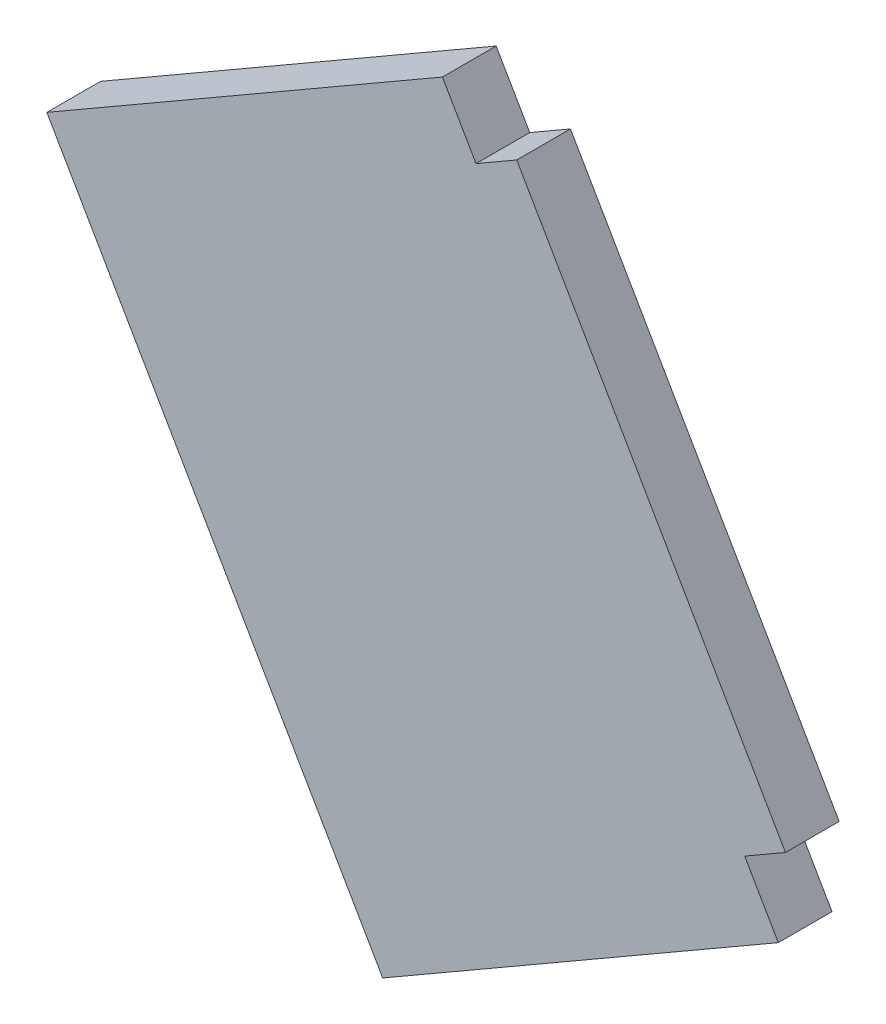
ISO-10303-21;
HEADER;
FILE_DESCRIPTION(('STEP AP214'),'2;1');
FILE_NAME('part.step','',(''),(''),'','','');
FILE_SCHEMA(('AUTOMOTIVE_DESIGN { 1 0 10303 214 1 1 1 1 }'));
ENDSEC;
DATA;
#1=APPLICATION_CONTEXT('core data for automotive mechanical design processes');
#2=APPLICATION_PROTOCOL_DEFINITION('international standard','automotive_design',2000,#1);
#3=PRODUCT_CONTEXT('',#1,'mechanical');
#4=PRODUCT('Part','Part','',(#3));
#5=PRODUCT_RELATED_PRODUCT_CATEGORY('part','',(#4));
#6=PRODUCT_DEFINITION_FORMATION('','',#4);
#7=PRODUCT_DEFINITION_CONTEXT('part definition',#1,'design');
#8=PRODUCT_DEFINITION('design','',#6,#7);
#9=PRODUCT_DEFINITION_SHAPE('','',#8);
#10=(LENGTH_UNIT() NAMED_UNIT(*) SI_UNIT(.MILLI.,.METRE.));
#11=(NAMED_UNIT(*) PLANE_ANGLE_UNIT() SI_UNIT($,.RADIAN.));
#12=(NAMED_UNIT(*) SI_UNIT($,.STERADIAN.) SOLID_ANGLE_UNIT());
#13=UNCERTAINTY_MEASURE_WITH_UNIT(LENGTH_MEASURE(1.E-05),#10,'distance_accuracy_value','');
#14=(GEOMETRIC_REPRESENTATION_CONTEXT(3) GLOBAL_UNCERTAINTY_ASSIGNED_CONTEXT((#13)) GLOBAL_UNIT_ASSIGNED_CONTEXT((#10,
#11,#12)) REPRESENTATION_CONTEXT('',''));
#15=CARTESIAN_POINT('',(0.,0.,0.));
#16=DIRECTION('',(0.,0.,1.));
#17=DIRECTION('',(1.,0.,0.));
#18=AXIS2_PLACEMENT_3D('',#15,#16,#17);
#19=CARTESIAN_POINT('',(-1.42664718204935,-1.40102540378444,0.));
#20=DIRECTION('',(0.500000000000001,-0.866025403784438,0.));
#21=DIRECTION('',(0.866025403784438,0.500000000000001,0.));
#22=AXIS2_PLACEMENT_3D('',#19,#20,#21);
#23=PLANE('',#22);
#24=DIRECTION('',(0.866025403784438,0.500000000000001,0.));
#25=VECTOR('',#24,1.);
#26=CARTESIAN_POINT('',(-1.42664718204935,-1.40102540378444,0.08));
#27=LINE('',#26,#25);
#28=CARTESIAN_POINT('',(-2.01554445662277,-1.74102540378444,0.08));
#29=VERTEX_POINT('',#28);
#30=CARTESIAN_POINT('',(-1.42664718204935,-1.40102540378444,0.08));
#31=VERTEX_POINT('',#30);
#32=EDGE_CURVE('E130',#29,#31,#27,.T.);
#33=ORIENTED_EDGE('',*,*,#32,.F.);
#34=DIRECTION('',(0.,0.,1.));
#35=VECTOR('',#34,1.);
#36=CARTESIAN_POINT('',(-2.01554445662277,-1.74102540378444,0.));
#37=LINE('',#36,#35);
#38=CARTESIAN_POINT('',(-2.01554445662277,-1.74102540378444,0.));
#39=VERTEX_POINT('',#38);
#40=EDGE_CURVE('E11',#39,#29,#37,.T.);
#41=ORIENTED_EDGE('',*,*,#40,.F.);
#42=DIRECTION('',(0.866025403784438,0.500000000000001,0.));
#43=VECTOR('',#42,1.);
#44=CARTESIAN_POINT('',(-1.42664718204935,-1.40102540378444,0.));
#45=LINE('',#44,#43);
#46=CARTESIAN_POINT('',(-1.42664718204935,-1.40102540378444,0.));
#47=VERTEX_POINT('',#46);
#48=EDGE_CURVE('E150',#39,#47,#45,.T.);
#49=ORIENTED_EDGE('',*,*,#48,.T.);
#50=DIRECTION('',(0.,0.,1.));
#51=VECTOR('',#50,1.);
#52=CARTESIAN_POINT('',(-1.42664718204935,-1.40102540378444,0.));
#53=LINE('',#52,#51);
#54=EDGE_CURVE('E36',#47,#31,#53,.T.);
#55=ORIENTED_EDGE('',*,*,#54,.T.);
#56=EDGE_LOOP('',(#33,#41,#49,#55));
#57=FACE_BOUND('',#56,.T.);
#58=ADVANCED_FACE('F33',(#57),#23,.T.);
#59=CARTESIAN_POINT('',(-2.51554445662277,-0.875000000000002,0.));
#60=DIRECTION('',(-0.866025403784438,-0.5,0.));
#61=DIRECTION('',(0.5,-0.866025403784438,0.));
#62=AXIS2_PLACEMENT_3D('',#59,#60,#61);
#63=PLANE('',#62);
#64=DIRECTION('',(0.5,-0.866025403784438,0.));
#65=VECTOR('',#64,1.);
#66=CARTESIAN_POINT('',(-2.51554445662277,-0.875000000000002,0.08));
#67=LINE('',#66,#65);
#68=CARTESIAN_POINT('',(-2.51554445662277,-0.875000000000002,0.08));
#69=VERTEX_POINT('',#68);
#70=EDGE_CURVE('E148',#69,#29,#67,.T.);
#71=ORIENTED_EDGE('',*,*,#70,.F.);
#72=DIRECTION('',(0.,0.,1.));
#73=VECTOR('',#72,1.);
#74=CARTESIAN_POINT('',(-2.51554445662277,-0.875000000000002,0.));
#75=LINE('',#74,#73);
#76=CARTESIAN_POINT('',(-2.51554445662277,-0.875000000000002,0.));
#77=VERTEX_POINT('',#76);
#78=EDGE_CURVE('E42',#77,#69,#75,.T.);
#79=ORIENTED_EDGE('',*,*,#78,.F.);
#80=DIRECTION('',(0.5,-0.866025403784438,0.));
#81=VECTOR('',#80,1.);
#82=CARTESIAN_POINT('',(-2.51554445662277,-0.875000000000002,0.));
#83=LINE('',#82,#81);
#84=EDGE_CURVE('E120',#77,#39,#83,.T.);
#85=ORIENTED_EDGE('',*,*,#84,.T.);
#86=ORIENTED_EDGE('',*,*,#40,.T.);
#87=EDGE_LOOP('',(#71,#79,#85,#86));
#88=FACE_BOUND('',#87,.T.);
#89=ADVANCED_FACE('F162',(#88),#63,.T.);
#90=CARTESIAN_POINT('',(-1.92664718204935,-0.535000000000002,0.));
#91=DIRECTION('',(-0.500000000000001,0.866025403784438,0.));
#92=DIRECTION('',(-0.866025403784438,-0.500000000000001,0.));
#93=AXIS2_PLACEMENT_3D('',#90,#91,#92);
#94=PLANE('',#93);
#95=DIRECTION('',(-0.866025403784438,-0.500000000000001,0.));
#96=VECTOR('',#95,1.);
#97=CARTESIAN_POINT('',(-1.92664718204935,-0.535000000000002,0.08));
#98=LINE('',#97,#96);
#99=CARTESIAN_POINT('',(-1.92664718204935,-0.535000000000002,0.08));
#100=VERTEX_POINT('',#99);
#101=EDGE_CURVE('E107',#100,#69,#98,.T.);
#102=ORIENTED_EDGE('',*,*,#101,.F.);
#103=DIRECTION('',(0.,0.,1.));
#104=VECTOR('',#103,1.);
#105=CARTESIAN_POINT('',(-1.92664718204935,-0.535000000000002,0.));
#106=LINE('',#105,#104);
#107=CARTESIAN_POINT('',(-1.92664718204935,-0.535000000000002,0.));
#108=VERTEX_POINT('',#107);
#109=EDGE_CURVE('E102',#108,#100,#106,.T.);
#110=ORIENTED_EDGE('',*,*,#109,.F.);
#111=DIRECTION('',(-0.866025403784438,-0.500000000000001,0.));
#112=VECTOR('',#111,1.);
#113=CARTESIAN_POINT('',(-1.92664718204935,-0.535000000000002,0.));
#114=LINE('',#113,#112);
#115=EDGE_CURVE('E105',#108,#77,#114,.T.);
#116=ORIENTED_EDGE('',*,*,#115,.T.);
#117=ORIENTED_EDGE('',*,*,#78,.T.);
#118=EDGE_LOOP('',(#102,#110,#116,#117));
#119=FACE_BOUND('',#118,.T.);
#120=ADVANCED_FACE('F104',(#119),#94,.T.);
#121=CARTESIAN_POINT('',(-1.92664718204935,-0.535000000000002,0.));
#122=DIRECTION('',(0.866025403784438,0.500000000000002,0.));
#123=DIRECTION('',(-0.500000000000002,0.866025403784438,0.));
#124=AXIS2_PLACEMENT_3D('',#121,#122,#123);
#125=PLANE('',#124);
#126=DIRECTION('',(-0.500000000000002,0.866025403784438,0.));
#127=VECTOR('',#126,1.);
#128=CARTESIAN_POINT('',(-1.92664718204935,-0.535000000000002,0.08));
#129=LINE('',#128,#127);
#130=CARTESIAN_POINT('',(-1.87664718204935,-0.621602540378445,0.08));
#131=VERTEX_POINT('',#130);
#132=EDGE_CURVE('E145',#131,#100,#129,.T.);
#133=ORIENTED_EDGE('',*,*,#132,.F.);
#134=DIRECTION('',(0.,0.,1.));
#135=VECTOR('',#134,1.);
#136=CARTESIAN_POINT('',(-1.87664718204935,-0.621602540378445,0.));
#137=LINE('',#136,#135);
#138=CARTESIAN_POINT('',(-1.87664718204935,-0.621602540378445,0.));
#139=VERTEX_POINT('',#138);
#140=EDGE_CURVE('E112',#139,#131,#137,.T.);
#141=ORIENTED_EDGE('',*,*,#140,.F.);
#142=DIRECTION('',(-0.500000000000002,0.866025403784438,0.));
#143=VECTOR('',#142,1.);
#144=CARTESIAN_POINT('',(-1.92664718204935,-0.535000000000002,0.));
#145=LINE('',#144,#143);
#146=EDGE_CURVE('E118',#139,#108,#145,.T.);
#147=ORIENTED_EDGE('',*,*,#146,.T.);
#148=ORIENTED_EDGE('',*,*,#109,.T.);
#149=EDGE_LOOP('',(#133,#141,#147,#148));
#150=FACE_BOUND('',#149,.T.);
#151=ADVANCED_FACE('F122',(#150),#125,.T.);
#152=CARTESIAN_POINT('',(-1.87664718204935,-0.621602540378445,0.));
#153=DIRECTION('',(-0.5,0.866025403784439,0.));
#154=DIRECTION('',(-0.866025403784439,-0.5,0.));
#155=AXIS2_PLACEMENT_3D('',#152,#153,#154);
#156=PLANE('',#155);
#157=DIRECTION('',(-0.866025403784439,-0.5,0.));
#158=VECTOR('',#157,1.);
#159=CARTESIAN_POINT('',(-1.87664718204935,-0.621602540378445,0.08));
#160=LINE('',#159,#158);
#161=CARTESIAN_POINT('',(-1.81602540378444,-0.586602540378445,0.08));
#162=VERTEX_POINT('',#161);
#163=EDGE_CURVE('E142',#162,#131,#160,.T.);
#164=ORIENTED_EDGE('',*,*,#163,.F.);
#165=DIRECTION('',(0.,0.,1.));
#166=VECTOR('',#165,1.);
#167=CARTESIAN_POINT('',(-1.81602540378444,-0.586602540378445,0.));
#168=LINE('',#167,#166);
#169=CARTESIAN_POINT('',(-1.81602540378444,-0.586602540378445,0.));
#170=VERTEX_POINT('',#169);
#171=EDGE_CURVE('E154',#170,#162,#168,.T.);
#172=ORIENTED_EDGE('',*,*,#171,.F.);
#173=DIRECTION('',(-0.866025403784439,-0.5,0.));
#174=VECTOR('',#173,1.);
#175=CARTESIAN_POINT('',(-1.87664718204935,-0.621602540378445,0.));
#176=LINE('',#175,#174);
#177=EDGE_CURVE('E123',#170,#139,#176,.T.);
#178=ORIENTED_EDGE('',*,*,#177,.T.);
#179=ORIENTED_EDGE('',*,*,#140,.T.);
#180=EDGE_LOOP('',(#164,#172,#178,#179));
#181=FACE_BOUND('',#180,.T.);
#182=ADVANCED_FACE('F175',(#181),#156,.T.);
#183=CARTESIAN_POINT('',(-1.81602540378444,-0.586602540378445,0.));
#184=DIRECTION('',(0.866025403784438,0.500000000000001,0.));
#185=DIRECTION('',(-0.500000000000001,0.866025403784438,0.));
#186=AXIS2_PLACEMENT_3D('',#183,#184,#185);
#187=PLANE('',#186);
#188=DIRECTION('',(-0.500000000000001,0.866025403784438,0.));
#189=VECTOR('',#188,1.);
#190=CARTESIAN_POINT('',(-1.81602540378444,-0.586602540378445,0.08));
#191=LINE('',#190,#189);
#192=CARTESIAN_POINT('',(-1.41602540378444,-1.279422863406,0.08));
#193=VERTEX_POINT('',#192);
#194=EDGE_CURVE('E139',#193,#162,#191,.T.);
#195=ORIENTED_EDGE('',*,*,#194,.F.);
#196=DIRECTION('',(0.,0.,1.));
#197=VECTOR('',#196,1.);
#198=CARTESIAN_POINT('',(-1.41602540378444,-1.279422863406,0.));
#199=LINE('',#198,#197);
#200=CARTESIAN_POINT('',(-1.41602540378444,-1.279422863406,0.));
#201=VERTEX_POINT('',#200);
#202=EDGE_CURVE('E156',#201,#193,#199,.T.);
#203=ORIENTED_EDGE('',*,*,#202,.F.);
#204=DIRECTION('',(-0.500000000000001,0.866025403784438,0.));
#205=VECTOR('',#204,1.);
#206=CARTESIAN_POINT('',(-1.81602540378444,-0.586602540378445,0.));
#207=LINE('',#206,#205);
#208=EDGE_CURVE('E125',#201,#170,#207,.T.);
#209=ORIENTED_EDGE('',*,*,#208,.T.);
#210=ORIENTED_EDGE('',*,*,#171,.T.);
#211=EDGE_LOOP('',(#195,#203,#209,#210));
#212=FACE_BOUND('',#211,.T.);
#213=ADVANCED_FACE('F178',(#212),#187,.T.);
#214=CARTESIAN_POINT('',(-1.47664718204935,-1.314422863406,0.));
#215=DIRECTION('',(0.499999999999999,-0.866025403784439,0.));
#216=DIRECTION('',(0.866025403784439,0.499999999999999,0.));
#217=AXIS2_PLACEMENT_3D('',#214,#215,#216);
#218=PLANE('',#217);
#219=DIRECTION('',(0.866025403784439,0.499999999999999,0.));
#220=VECTOR('',#219,1.);
#221=CARTESIAN_POINT('',(-1.47664718204935,-1.314422863406,0.08));
#222=LINE('',#221,#220);
#223=CARTESIAN_POINT('',(-1.47664718204935,-1.314422863406,0.08));
#224=VERTEX_POINT('',#223);
#225=EDGE_CURVE('E136',#224,#193,#222,.T.);
#226=ORIENTED_EDGE('',*,*,#225,.F.);
#227=DIRECTION('',(0.,0.,1.));
#228=VECTOR('',#227,1.);
#229=CARTESIAN_POINT('',(-1.47664718204935,-1.314422863406,0.));
#230=LINE('',#229,#228);
#231=CARTESIAN_POINT('',(-1.47664718204935,-1.314422863406,0.));
#232=VERTEX_POINT('',#231);
#233=EDGE_CURVE('E157',#232,#224,#230,.T.);
#234=ORIENTED_EDGE('',*,*,#233,.F.);
#235=DIRECTION('',(0.866025403784439,0.499999999999999,0.));
#236=VECTOR('',#235,1.);
#237=CARTESIAN_POINT('',(-1.47664718204935,-1.314422863406,0.));
#238=LINE('',#237,#236);
#239=EDGE_CURVE('E253',#232,#201,#238,.T.);
#240=ORIENTED_EDGE('',*,*,#239,.T.);
#241=ORIENTED_EDGE('',*,*,#202,.T.);
#242=EDGE_LOOP('',(#226,#234,#240,#241));
#243=FACE_BOUND('',#242,.T.);
#244=ADVANCED_FACE('F182',(#243),#218,.T.);
#245=CARTESIAN_POINT('',(-1.42664718204935,-1.40102540378444,0.));
#246=DIRECTION('',(0.866025403784438,0.500000000000002,0.));
#247=DIRECTION('',(-0.500000000000002,0.866025403784438,0.));
#248=AXIS2_PLACEMENT_3D('',#245,#246,#247);
#249=PLANE('',#248);
#250=DIRECTION('',(-0.500000000000002,0.866025403784438,0.));
#251=VECTOR('',#250,1.);
#252=CARTESIAN_POINT('',(-1.42664718204935,-1.40102540378444,0.08));
#253=LINE('',#252,#251);
#254=EDGE_CURVE('E133',#31,#224,#253,.T.);
#255=ORIENTED_EDGE('',*,*,#254,.F.);
#256=ORIENTED_EDGE('',*,*,#54,.F.);
#257=DIRECTION('',(-0.500000000000002,0.866025403784438,0.));
#258=VECTOR('',#257,1.);
#259=CARTESIAN_POINT('',(-1.42664718204935,-1.40102540378444,0.));
#260=LINE('',#259,#258);
#261=EDGE_CURVE('E254',#47,#232,#260,.T.);
#262=ORIENTED_EDGE('',*,*,#261,.T.);
#263=ORIENTED_EDGE('',*,*,#233,.T.);
#264=EDGE_LOOP('',(#255,#256,#262,#263));
#265=FACE_BOUND('',#264,.T.);
#266=ADVANCED_FACE('F159',(#265),#249,.T.);
#267=CARTESIAN_POINT('',(0.,0.,0.));
#268=DIRECTION('',(0.,0.,1.));
#269=DIRECTION('',(1.,0.,0.));
#270=AXIS2_PLACEMENT_3D('',#267,#268,#269);
#271=PLANE('',#270);
#272=ORIENTED_EDGE('',*,*,#48,.F.);
#273=ORIENTED_EDGE('',*,*,#84,.F.);
#274=ORIENTED_EDGE('',*,*,#115,.F.);
#275=ORIENTED_EDGE('',*,*,#146,.F.);
#276=ORIENTED_EDGE('',*,*,#177,.F.);
#277=ORIENTED_EDGE('',*,*,#208,.F.);
#278=ORIENTED_EDGE('',*,*,#239,.F.);
#279=ORIENTED_EDGE('',*,*,#261,.F.);
#280=EDGE_LOOP('',(#272,#273,#274,#275,#276,#277,#278,#279));
#281=FACE_BOUND('',#280,.T.);
#282=ADVANCED_FACE('F116',(#281),#271,.F.);
#283=CARTESIAN_POINT('',(0.,0.,0.08));
#284=DIRECTION('',(0.,0.,1.));
#285=DIRECTION('',(1.,0.,0.));
#286=AXIS2_PLACEMENT_3D('',#283,#284,#285);
#287=PLANE('',#286);
#288=ORIENTED_EDGE('',*,*,#32,.T.);
#289=ORIENTED_EDGE('',*,*,#254,.T.);
#290=ORIENTED_EDGE('',*,*,#225,.T.);
#291=ORIENTED_EDGE('',*,*,#194,.T.);
#292=ORIENTED_EDGE('',*,*,#163,.T.);
#293=ORIENTED_EDGE('',*,*,#132,.T.);
#294=ORIENTED_EDGE('',*,*,#101,.T.);
#295=ORIENTED_EDGE('',*,*,#70,.T.);
#296=EDGE_LOOP('',(#288,#289,#290,#291,#292,#293,#294,#295));
#297=FACE_BOUND('',#296,.T.);
#298=ADVANCED_FACE('F161',(#297),#287,.T.);
#299=CLOSED_SHELL('',(#58,#89,#120,#151,#182,#213,#244,#266,#282,#298));
#300=MANIFOLD_SOLID_BREP('B2',#299);
#301=ADVANCED_BREP_SHAPE_REPRESENTATION('',(#18,#300),#14);
#302=SHAPE_DEFINITION_REPRESENTATION(#9,#301);
ENDSEC;
END-ISO-10303-21;
